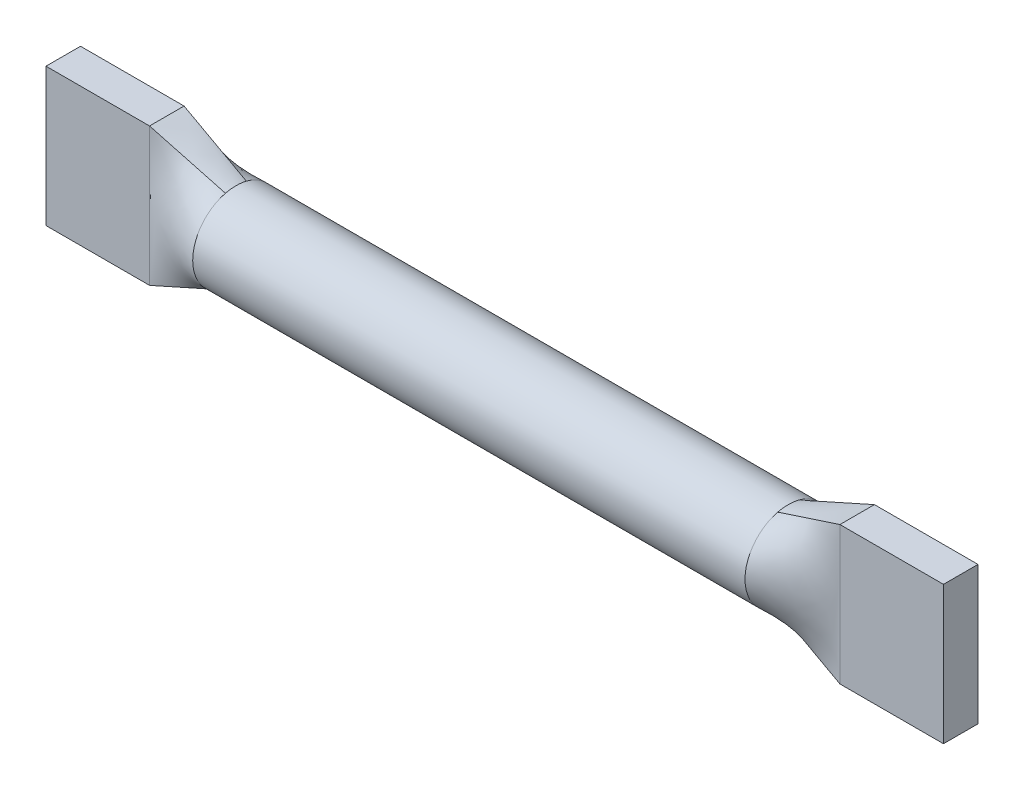
ISO-10303-21;
HEADER;
FILE_DESCRIPTION(('STEP AP214'),'2;1');
FILE_NAME('part.step','',(''),(''),'','','');
FILE_SCHEMA(('AUTOMOTIVE_DESIGN { 1 0 10303 214 1 1 1 1 }'));
ENDSEC;
DATA;
#1=APPLICATION_CONTEXT('core data for automotive mechanical design processes');
#2=APPLICATION_PROTOCOL_DEFINITION('international standard','automotive_design',2000,#1);
#3=PRODUCT_CONTEXT('',#1,'mechanical');
#4=PRODUCT('Part','Part','',(#3));
#5=PRODUCT_RELATED_PRODUCT_CATEGORY('part','',(#4));
#6=PRODUCT_DEFINITION_FORMATION('','',#4);
#7=PRODUCT_DEFINITION_CONTEXT('part definition',#1,'design');
#8=PRODUCT_DEFINITION('design','',#6,#7);
#9=PRODUCT_DEFINITION_SHAPE('','',#8);
#10=(LENGTH_UNIT() NAMED_UNIT(*) SI_UNIT(.MILLI.,.METRE.));
#11=(NAMED_UNIT(*) PLANE_ANGLE_UNIT() SI_UNIT($,.RADIAN.));
#12=(NAMED_UNIT(*) SI_UNIT($,.STERADIAN.) SOLID_ANGLE_UNIT());
#13=UNCERTAINTY_MEASURE_WITH_UNIT(LENGTH_MEASURE(1.E-05),#10,'distance_accuracy_value','');
#14=(GEOMETRIC_REPRESENTATION_CONTEXT(3) GLOBAL_UNCERTAINTY_ASSIGNED_CONTEXT((#13)) GLOBAL_UNIT_ASSIGNED_CONTEXT((#10,
#11,#12)) REPRESENTATION_CONTEXT('',''));
#15=CARTESIAN_POINT('',(0.,0.,0.));
#16=DIRECTION('',(0.,0.,1.));
#17=DIRECTION('',(1.,0.,0.));
#18=AXIS2_PLACEMENT_3D('',#15,#16,#17);
#19=CARTESIAN_POINT('',(4.,0.,0.));
#20=DIRECTION('',(-1.,0.,0.));
#21=DIRECTION('',(0.,0.,1.));
#22=AXIS2_PLACEMENT_3D('',#19,#20,#21);
#23=CYLINDRICAL_SURFACE('',#22,0.625);
#24=CARTESIAN_POINT('',(4.,0.606339039560121,-0.151584857770569));
#25=CARTESIAN_POINT('',(4.00002319869924,0.611432264371149,-0.131230323229949));
#26=CARTESIAN_POINT('',(4.00015953802985,0.615492700544378,-0.110614814075321));
#27=CARTESIAN_POINT('',(4.00045778826887,0.621521119742954,-0.069098322334352));
#28=CARTESIAN_POINT('',(4.00061967697582,0.623490908088315,-0.0481976018590627));
#29=CARTESIAN_POINT('',(4.00074736257878,0.625054477077351,-0.0123925371506096));
#30=CARTESIAN_POINT('',(4.00075644923271,0.625172099094219,0.00249072512299087));
#31=CARTESIAN_POINT('',(4.00068890808599,0.624345695991257,0.0322264147045635));
#32=CARTESIAN_POINT('',(4.00061229224982,0.62340181906183,0.0470788460267166));
#33=CARTESIAN_POINT('',(4.00041095379841,0.620425681626127,0.076990671397577));
#34=CARTESIAN_POINT('',(4.00028524940299,0.61837085688521,0.092047812070457));
#35=CARTESIAN_POINT('',(4.00008221403026,0.613170308925043,0.121976385342566));
#36=CARTESIAN_POINT('',(4.00000489433789,0.610024331477865,0.13684777382606));
#37=CARTESIAN_POINT('',(4.,0.606339018940256,0.151584940250014));
#38=B_SPLINE_CURVE_WITH_KNOTS('',3,(#24,#25,#26,#27,#28,#29,#30,#31,#32,#33,#34,#35,#36,#37),
.UNSPECIFIED.,.F.,.F.,(4,2,2,2,2,2,4),(0.,0.0629259388945802,0.125797495548134,
0.170412925881736,0.215022128457891,0.260573417572076,0.306135326829082),.UNSPECIFIED.);
#39=CARTESIAN_POINT('',(4.,0.606395418070268,-0.151598952407199));
#40=VERTEX_POINT('',#39);
#41=CARTESIAN_POINT('',(4.,0.606382766635631,0.151595877185707));
#42=VERTEX_POINT('',#41);
#43=EDGE_CURVE('E12',#40,#42,#38,.T.);
#44=ORIENTED_EDGE('',*,*,#43,.F.);
#45=CARTESIAN_POINT('',(4.,0.,0.));
#46=DIRECTION('',(1.,0.,0.));
#47=DIRECTION('',(0.,0.,-1.));
#48=AXIS2_PLACEMENT_3D('',#45,#46,#47);
#49=CIRCLE('',#48,0.625);
#50=CARTESIAN_POINT('',(4.,-0.606382766792094,-0.151595877225487));
#51=VERTEX_POINT('',#50);
#52=EDGE_CURVE('E119',#51,#40,#49,.T.);
#53=ORIENTED_EDGE('',*,*,#52,.F.);
#54=CARTESIAN_POINT('',(4.,-0.606339039560107,0.151584857770624));
#55=CARTESIAN_POINT('',(4.00002319869924,-0.611432264371138,0.131230323230004));
#56=CARTESIAN_POINT('',(4.00015953802985,-0.615492700544368,0.110614814075377));
#57=CARTESIAN_POINT('',(4.00045778826887,-0.621521119742948,0.0690983223344087));
#58=CARTESIAN_POINT('',(4.00061967697582,-0.62349090808831,0.0481976018591196));
#59=CARTESIAN_POINT('',(4.00074736257878,-0.625054477077352,0.01239253715061));
#60=CARTESIAN_POINT('',(4.00075644923271,-0.62517209909422,-0.00249072512304715));
#61=CARTESIAN_POINT('',(4.00068890808598,-0.62434569599125,-0.0322264147047328));
#62=CARTESIAN_POINT('',(4.00061229224982,-0.623401819061814,-0.0470788460269422));
#63=CARTESIAN_POINT('',(4.00041095379841,-0.620425681626086,-0.0769906713979176));
#64=CARTESIAN_POINT('',(4.00028524940299,-0.618370856885152,-0.0920478120708561));
#65=CARTESIAN_POINT('',(4.00008221403025,-0.613170308924942,-0.12197638534308));
#66=CARTESIAN_POINT('',(4.00000489433789,-0.610024331477738,-0.136847773826631));
#67=CARTESIAN_POINT('',(4.,-0.6063390189401,-0.151584940250639));
#68=B_SPLINE_CURVE_WITH_KNOTS('',3,(#54,#55,#56,#57,#58,#59,#60,#61,#62,#63,#64,#65,#66,#67),
.UNSPECIFIED.,.F.,.F.,(4,2,2,2,2,2,4),(0.,0.0629259388945799,0.125797495548134,
0.170412925881905,0.21502212845823,0.260573417572596,0.306135326829783),.UNSPECIFIED.);
#69=CARTESIAN_POINT('',(4.,-0.606395418103955,0.151598952415679));
#70=VERTEX_POINT('',#69);
#71=EDGE_CURVE('E428',#70,#51,#68,.T.);
#72=ORIENTED_EDGE('',*,*,#71,.F.);
#73=EDGE_CURVE('E508',#42,#70,#49,.T.);
#74=ORIENTED_EDGE('',*,*,#73,.F.);
#75=EDGE_LOOP('',(#44,#53,#72,#74));
#76=FACE_BOUND('',#75,.T.);
#77=CARTESIAN_POINT('',(-4.,0.606339062590832,0.151584765647708));
#78=CARTESIAN_POINT('',(-4.,0.618593964551617,0.102565157804571));
#79=CARTESIAN_POINT('',(-4.,0.624721415532009,0.0512825789022855));
#80=CARTESIAN_POINT('',(-4.,0.624721415532009,-0.0512825789022854));
#81=CARTESIAN_POINT('',(-4.,0.618593964551617,-0.102565157804571));
#82=CARTESIAN_POINT('',(-4.,0.606339062590832,-0.151584765647708));
#83=B_SPLINE_CURVE_WITH_KNOTS('',3,(#77,#78,#79,#80,#81,#82),.UNSPECIFIED.,.F.,.F.,(4,2,4),(0.,
0.5,1.),.UNSPECIFIED.);
#84=CARTESIAN_POINT('',(-4.,0.60705828899856,-0.151748952927144));
#85=VERTEX_POINT('',#84);
#86=CARTESIAN_POINT('',(-4.,0.607005347778301,0.151735841346693));
#87=VERTEX_POINT('',#86);
#88=EDGE_CURVE('E102',#85,#87,#83,.F.);
#89=ORIENTED_EDGE('',*,*,#88,.T.);
#90=CARTESIAN_POINT('',(-4.,0.,0.));
#91=DIRECTION('',(1.,0.,0.));
#92=DIRECTION('',(0.,0.,-1.));
#93=AXIS2_PLACEMENT_3D('',#90,#91,#92);
#94=CIRCLE('',#93,0.625);
#95=CARTESIAN_POINT('',(-4.,-0.607058251111747,0.151748944278222));
#96=VERTEX_POINT('',#95);
#97=EDGE_CURVE('E110',#87,#96,#94,.T.);
#98=ORIENTED_EDGE('',*,*,#97,.T.);
#99=CARTESIAN_POINT('',(-4.,-0.60700538806345,-0.151735850481081));
#100=VERTEX_POINT('',#99);
#101=EDGE_CURVE('E303',#96,#100,#94,.T.);
#102=ORIENTED_EDGE('',*,*,#101,.T.);
#103=EDGE_CURVE('E198',#100,#85,#94,.T.);
#104=ORIENTED_EDGE('',*,*,#103,.T.);
#105=EDGE_LOOP('',(#89,#98,#102,#104));
#106=FACE_BOUND('',#105,.T.);
#107=ADVANCED_FACE('F92',(#76,#106),#23,.T.);
#108=CARTESIAN_POINT('',(5.,-1.,0.25));
#109=CARTESIAN_POINT('',(4.,-0.606339062590832,0.151584765647708));
#110=CARTESIAN_POINT('',(5.,-0.833333333333333,0.25));
#111=CARTESIAN_POINT('',(4.,-0.581829258669264,0.249623981333983));
#112=CARTESIAN_POINT('',(5.,-0.666666666666667,0.25));
#113=CARTESIAN_POINT('',(4.,-0.527266641714546,0.364058002825046));
#114=CARTESIAN_POINT('',(5.,-0.416666666666667,0.25));
#115=CARTESIAN_POINT('',(4.,-0.371541972222834,0.507506057203499));
#116=CARTESIAN_POINT('',(5.,-0.333333333333333,0.25));
#117=CARTESIAN_POINT('',(4.,-0.307632412302998,0.549659321541145));
#118=CARTESIAN_POINT('',(5.,-0.166666666666666,0.25));
#119=CARTESIAN_POINT('',(4.,-0.162442635781475,0.60858480176291));
#120=CARTESIAN_POINT('',(5.,-0.083333333333333,0.25));
#121=CARTESIAN_POINT('',(4.,-0.0813308756671265,0.625));
#122=CARTESIAN_POINT('',(5.,0.0833333333333337,0.25));
#123=CARTESIAN_POINT('',(4.,0.0813308756671266,0.625));
#124=CARTESIAN_POINT('',(5.,0.166666666666667,0.25));
#125=CARTESIAN_POINT('',(4.,0.162442635781475,0.60858480176291));
#126=CARTESIAN_POINT('',(5.,0.333333333333333,0.25));
#127=CARTESIAN_POINT('',(4.,0.307632412302998,0.549659321541145));
#128=CARTESIAN_POINT('',(5.,0.416666666666667,0.25));
#129=CARTESIAN_POINT('',(4.,0.371541972222834,0.507506057203499));
#130=CARTESIAN_POINT('',(5.,0.666666666666667,0.25));
#131=CARTESIAN_POINT('',(4.,0.527266641714546,0.364058002825045));
#132=CARTESIAN_POINT('',(5.,0.833333333333333,0.25));
#133=CARTESIAN_POINT('',(4.,0.581829258669264,0.249623981333983));
#134=CARTESIAN_POINT('',(5.,1.,0.25));
#135=CARTESIAN_POINT('',(4.,0.606339062590832,0.151584765647708));
#136=B_SPLINE_SURFACE_WITH_KNOTS('',3,1,((#108,#109),(#110,#111),(#112,#113),(#114,#115),(#116,
#117),(#118,#119),(#120,#121),(#122,#123),(#124,#125),(#126,#127),(#128,#129),(#130,#131),(#132,
#133),(#134,#135)),.UNSPECIFIED.,.F.,.F.,.F.,(4,2,2,2,2,2,4),(2,2),(0.,0.25,0.375,0.5,0.625,
0.75,1.),(0.,1.),.UNSPECIFIED.);
#137=DIRECTION('',(0.,-1.,0.));
#138=VECTOR('',#137,1.);
#139=CARTESIAN_POINT('',(5.,-1.,0.25));
#140=LINE('',#139,#138);
#141=CARTESIAN_POINT('',(5.,1.,0.25));
#142=VERTEX_POINT('',#141);
#143=CARTESIAN_POINT('',(5.,-1.,0.25));
#144=VERTEX_POINT('',#143);
#145=EDGE_CURVE('E573',#142,#144,#140,.T.);
#146=DIRECTION('',(-0.926619524762666,-0.364773910739708,-0.0911934776849271));
#147=VECTOR('',#146,1.);
#148=CARTESIAN_POINT('',(4.5,0.803169531295416,0.200792382823854));
#149=LINE('',#148,#147);
#150=EDGE_CURVE('E570',#142,#42,#149,.T.);
#151=DIRECTION('',(0.926619524762666,-0.364773910739708,0.0911934776849269));
#152=VECTOR('',#151,1.);
#153=CARTESIAN_POINT('',(4.5,-0.803169531295416,0.200792382823854));
#154=LINE('',#153,#152);
#155=EDGE_CURVE('E574',#70,#144,#154,.T.);
#156=ORIENTED_EDGE('',*,*,#145,.F.);
#157=ORIENTED_EDGE('',*,*,#150,.T.);
#158=ORIENTED_EDGE('',*,*,#73,.T.);
#159=ORIENTED_EDGE('',*,*,#155,.T.);
#160=EDGE_LOOP('',(#156,#157,#158,#159));
#161=FACE_BOUND('',#160,.T.);
#162=ADVANCED_FACE('F460',(#161),#136,.T.);
#163=CARTESIAN_POINT('',(5.,1.,0.255));
#164=CARTESIAN_POINT('',(4.,0.605603768473185,0.154525942118296));
#165=CARTESIAN_POINT('',(5.,1.,0.253333333333333));
#166=CARTESIAN_POINT('',(4.,0.605848866512401,0.153545549961434));
#167=CARTESIAN_POINT('',(5.,1.,0.251666666666667));
#168=CARTESIAN_POINT('',(4.,0.606093964551617,0.152565157804571));
#169=CARTESIAN_POINT('',(5.,1.,0.25));
#170=CARTESIAN_POINT('',(4.,0.606339062590832,0.151584765647708));
#171=CARTESIAN_POINT('',(5.,1.,0.166666666666667));
#172=CARTESIAN_POINT('',(4.,0.618593964551617,0.102565157804571));
#173=CARTESIAN_POINT('',(5.,1.,0.0833333333333332));
#174=CARTESIAN_POINT('',(4.,0.624721415532009,0.0512825789022855));
#175=CARTESIAN_POINT('',(5.,1.,-0.0833333333333334));
#176=CARTESIAN_POINT('',(4.,0.624721415532009,-0.0512825789022854));
#177=CARTESIAN_POINT('',(5.,1.,-0.166666666666667));
#178=CARTESIAN_POINT('',(4.,0.618593964551617,-0.102565157804571));
#179=CARTESIAN_POINT('',(5.,1.,-0.25));
#180=CARTESIAN_POINT('',(4.,0.606339062590832,-0.151584765647708));
#181=CARTESIAN_POINT('',(5.,1.,-0.251666666666667));
#182=CARTESIAN_POINT('',(4.,0.606093964551617,-0.152565157804571));
#183=CARTESIAN_POINT('',(5.,1.,-0.253333333333333));
#184=CARTESIAN_POINT('',(4.,0.605848866512401,-0.153545549961434));
#185=CARTESIAN_POINT('',(5.,1.,-0.255));
#186=CARTESIAN_POINT('',(4.,0.605603768473185,-0.154525942118296));
#187=B_SPLINE_SURFACE_WITH_KNOTS('',3,1,((#163,#164),(#165,#166),(#167,#168),(#169,#170),(#171,
#172),(#173,#174),(#175,#176),(#177,#178),(#179,#180),(#181,#182),(#183,#184),(#185,#186)),
.UNSPECIFIED.,.F.,.F.,.F.,(4,3,2,3,4),(2,2),(-0.01,0.,0.5,1.,1.01),(0.,1.),.UNSPECIFIED.);
#188=DIRECTION('',(0.,0.,1.));
#189=VECTOR('',#188,1.);
#190=CARTESIAN_POINT('',(5.,1.,-0.25));
#191=LINE('',#190,#189);
#192=CARTESIAN_POINT('',(5.,1.,-0.25));
#193=VERTEX_POINT('',#192);
#194=EDGE_CURVE('E441',#193,#142,#191,.T.);
#195=DIRECTION('',(-0.926619524762666,-0.364773910739708,0.0911934776849271));
#196=VECTOR('',#195,1.);
#197=CARTESIAN_POINT('',(4.5,0.803169531295416,-0.200792382823854));
#198=LINE('',#197,#196);
#199=EDGE_CURVE('E572',#193,#40,#198,.T.);
#200=ORIENTED_EDGE('',*,*,#194,.F.);
#201=ORIENTED_EDGE('',*,*,#199,.T.);
#202=ORIENTED_EDGE('',*,*,#43,.T.);
#203=ORIENTED_EDGE('',*,*,#150,.F.);
#204=EDGE_LOOP('',(#200,#201,#202,#203));
#205=FACE_BOUND('',#204,.T.);
#206=ADVANCED_FACE('F406',(#205),#187,.T.);
#207=CARTESIAN_POINT('',(5.,-1.,-0.255));
#208=CARTESIAN_POINT('',(4.,-0.605603768473185,-0.154525942118296));
#209=CARTESIAN_POINT('',(5.,-1.,-0.253333333333333));
#210=CARTESIAN_POINT('',(4.,-0.605848866512401,-0.153545549961434));
#211=CARTESIAN_POINT('',(5.,-1.,-0.251666666666667));
#212=CARTESIAN_POINT('',(4.,-0.606093964551617,-0.152565157804571));
#213=CARTESIAN_POINT('',(5.,-1.,-0.25));
#214=CARTESIAN_POINT('',(4.,-0.606339062590832,-0.151584765647708));
#215=CARTESIAN_POINT('',(5.,-1.,-0.166666666666667));
#216=CARTESIAN_POINT('',(4.,-0.618593964551617,-0.102565157804571));
#217=CARTESIAN_POINT('',(5.,-1.,-0.0833333333333332));
#218=CARTESIAN_POINT('',(4.,-0.624721415532009,-0.0512825789022853));
#219=CARTESIAN_POINT('',(5.,-1.,0.0833333333333334));
#220=CARTESIAN_POINT('',(4.,-0.624721415532009,0.0512825789022856));
#221=CARTESIAN_POINT('',(5.,-1.,0.166666666666667));
#222=CARTESIAN_POINT('',(4.,-0.618593964551617,0.102565157804571));
#223=CARTESIAN_POINT('',(5.,-1.,0.25));
#224=CARTESIAN_POINT('',(4.,-0.606339062590832,0.151584765647708));
#225=CARTESIAN_POINT('',(5.,-1.,0.251666666666667));
#226=CARTESIAN_POINT('',(4.,-0.606093964551617,0.152565157804571));
#227=CARTESIAN_POINT('',(5.,-1.,0.253333333333333));
#228=CARTESIAN_POINT('',(4.,-0.605848866512401,0.153545549961434));
#229=CARTESIAN_POINT('',(5.,-1.,0.255));
#230=CARTESIAN_POINT('',(4.,-0.605603768473185,0.154525942118296));
#231=B_SPLINE_SURFACE_WITH_KNOTS('',3,1,((#207,#208),(#209,#210),(#211,#212),(#213,#214),(#215,
#216),(#217,#218),(#219,#220),(#221,#222),(#223,#224),(#225,#226),(#227,#228),(#229,#230)),
.UNSPECIFIED.,.F.,.F.,.F.,(4,3,2,3,4),(2,2),(-0.01,0.,0.5,1.,1.01),(0.,1.),.UNSPECIFIED.);
#232=DIRECTION('',(0.,0.,-1.));
#233=VECTOR('',#232,1.);
#234=CARTESIAN_POINT('',(5.,-1.,-0.25));
#235=LINE('',#234,#233);
#236=CARTESIAN_POINT('',(5.,-1.,-0.25));
#237=VERTEX_POINT('',#236);
#238=EDGE_CURVE('E386',#144,#237,#235,.T.);
#239=DIRECTION('',(-0.926619524762666,0.364773910739708,0.0911934776849271));
#240=VECTOR('',#239,1.);
#241=CARTESIAN_POINT('',(4.5,-0.803169531295416,-0.200792382823854));
#242=LINE('',#241,#240);
#243=EDGE_CURVE('E392',#237,#51,#242,.T.);
#244=ORIENTED_EDGE('',*,*,#238,.F.);
#245=ORIENTED_EDGE('',*,*,#155,.F.);
#246=ORIENTED_EDGE('',*,*,#71,.T.);
#247=ORIENTED_EDGE('',*,*,#243,.F.);
#248=EDGE_LOOP('',(#244,#245,#246,#247));
#249=FACE_BOUND('',#248,.T.);
#250=ADVANCED_FACE('F394',(#249),#231,.T.);
#251=CARTESIAN_POINT('',(5.,1.,-0.25));
#252=CARTESIAN_POINT('',(4.,0.606339062590832,-0.151584765647708));
#253=CARTESIAN_POINT('',(5.,0.833333333333333,-0.25));
#254=CARTESIAN_POINT('',(4.,0.581829258669264,-0.249623981333983));
#255=CARTESIAN_POINT('',(5.,0.666666666666666,-0.25));
#256=CARTESIAN_POINT('',(4.,0.527266641714546,-0.364058002825045));
#257=CARTESIAN_POINT('',(5.,0.416666666666666,-0.25));
#258=CARTESIAN_POINT('',(4.,0.371541972222834,-0.507506057203499));
#259=CARTESIAN_POINT('',(5.,0.333333333333333,-0.25));
#260=CARTESIAN_POINT('',(4.,0.307632412302998,-0.549659321541145));
#261=CARTESIAN_POINT('',(5.,0.166666666666666,-0.25));
#262=CARTESIAN_POINT('',(4.,0.162442635781475,-0.60858480176291));
#263=CARTESIAN_POINT('',(5.,0.0833333333333329,-0.25));
#264=CARTESIAN_POINT('',(4.,0.0813308756671265,-0.625));
#265=CARTESIAN_POINT('',(5.,-0.0833333333333338,-0.25));
#266=CARTESIAN_POINT('',(4.,-0.0813308756671266,-0.625));
#267=CARTESIAN_POINT('',(5.,-0.166666666666667,-0.25));
#268=CARTESIAN_POINT('',(4.,-0.162442635781475,-0.60858480176291));
#269=CARTESIAN_POINT('',(5.,-0.333333333333334,-0.25));
#270=CARTESIAN_POINT('',(4.,-0.307632412302998,-0.549659321541145));
#271=CARTESIAN_POINT('',(5.,-0.416666666666667,-0.25));
#272=CARTESIAN_POINT('',(4.,-0.371541972222834,-0.507506057203499));
#273=CARTESIAN_POINT('',(5.,-0.666666666666667,-0.25));
#274=CARTESIAN_POINT('',(4.,-0.527266641714546,-0.364058002825045));
#275=CARTESIAN_POINT('',(5.,-0.833333333333334,-0.25));
#276=CARTESIAN_POINT('',(4.,-0.581829258669264,-0.249623981333983));
#277=CARTESIAN_POINT('',(5.,-1.,-0.25));
#278=CARTESIAN_POINT('',(4.,-0.606339062590832,-0.151584765647708));
#279=B_SPLINE_SURFACE_WITH_KNOTS('',3,1,((#251,#252),(#253,#254),(#255,#256),(#257,#258),(#259,
#260),(#261,#262),(#263,#264),(#265,#266),(#267,#268),(#269,#270),(#271,#272),(#273,#274),(#275,
#276),(#277,#278)),.UNSPECIFIED.,.F.,.F.,.F.,(4,2,2,2,2,2,4),(2,2),(0.,0.25,0.375,0.5,0.625,
0.75,1.),(0.,1.),.UNSPECIFIED.);
#280=DIRECTION('',(0.,1.,0.));
#281=VECTOR('',#280,1.);
#282=CARTESIAN_POINT('',(5.,-1.,-0.25));
#283=LINE('',#282,#281);
#284=EDGE_CURVE('E525',#237,#193,#283,.T.);
#285=ORIENTED_EDGE('',*,*,#284,.F.);
#286=ORIENTED_EDGE('',*,*,#243,.T.);
#287=ORIENTED_EDGE('',*,*,#52,.T.);
#288=ORIENTED_EDGE('',*,*,#199,.F.);
#289=EDGE_LOOP('',(#285,#286,#287,#288));
#290=FACE_BOUND('',#289,.T.);
#291=ADVANCED_FACE('F405',(#290),#279,.T.);
#292=CARTESIAN_POINT('',(6.5,1.,-0.25));
#293=DIRECTION('',(0.,-1.,0.));
#294=DIRECTION('',(0.,0.,-1.));
#295=AXIS2_PLACEMENT_3D('',#292,#293,#294);
#296=PLANE('',#295);
#297=ORIENTED_EDGE('',*,*,#194,.T.);
#298=DIRECTION('',(-1.,0.,0.));
#299=VECTOR('',#298,1.);
#300=CARTESIAN_POINT('',(6.5,1.,0.25));
#301=LINE('',#300,#299);
#302=CARTESIAN_POINT('',(6.5,1.,0.25));
#303=VERTEX_POINT('',#302);
#304=EDGE_CURVE('E430',#303,#142,#301,.T.);
#305=ORIENTED_EDGE('',*,*,#304,.F.);
#306=DIRECTION('',(0.,0.,1.));
#307=VECTOR('',#306,1.);
#308=CARTESIAN_POINT('',(6.5,1.,-0.25));
#309=LINE('',#308,#307);
#310=CARTESIAN_POINT('',(6.5,1.,-0.25));
#311=VERTEX_POINT('',#310);
#312=EDGE_CURVE('E370',#311,#303,#309,.T.);
#313=ORIENTED_EDGE('',*,*,#312,.F.);
#314=DIRECTION('',(-1.,0.,0.));
#315=VECTOR('',#314,1.);
#316=CARTESIAN_POINT('',(6.5,1.,-0.25));
#317=LINE('',#316,#315);
#318=EDGE_CURVE('E379',#311,#193,#317,.T.);
#319=ORIENTED_EDGE('',*,*,#318,.T.);
#320=EDGE_LOOP('',(#297,#305,#313,#319));
#321=FACE_BOUND('',#320,.T.);
#322=ADVANCED_FACE('F448',(#321),#296,.F.);
#323=CARTESIAN_POINT('',(6.5,1.,0.25));
#324=DIRECTION('',(0.,0.,-1.));
#325=DIRECTION('',(-1.,0.,0.));
#326=AXIS2_PLACEMENT_3D('',#323,#324,#325);
#327=PLANE('',#326);
#328=ORIENTED_EDGE('',*,*,#145,.T.);
#329=DIRECTION('',(-1.,0.,0.));
#330=VECTOR('',#329,1.);
#331=CARTESIAN_POINT('',(6.5,-1.,0.25));
#332=LINE('',#331,#330);
#333=CARTESIAN_POINT('',(6.5,-1.,0.25));
#334=VERTEX_POINT('',#333);
#335=EDGE_CURVE('E433',#334,#144,#332,.T.);
#336=ORIENTED_EDGE('',*,*,#335,.F.);
#337=DIRECTION('',(0.,-1.,0.));
#338=VECTOR('',#337,1.);
#339=CARTESIAN_POINT('',(6.5,1.,0.25));
#340=LINE('',#339,#338);
#341=EDGE_CURVE('E373',#303,#334,#340,.T.);
#342=ORIENTED_EDGE('',*,*,#341,.F.);
#343=ORIENTED_EDGE('',*,*,#304,.T.);
#344=EDGE_LOOP('',(#328,#336,#342,#343));
#345=FACE_BOUND('',#344,.T.);
#346=ADVANCED_FACE('F457',(#345),#327,.F.);
#347=CARTESIAN_POINT('',(6.5,-1.,0.25));
#348=DIRECTION('',(0.,1.,0.));
#349=DIRECTION('',(0.,0.,1.));
#350=AXIS2_PLACEMENT_3D('',#347,#348,#349);
#351=PLANE('',#350);
#352=ORIENTED_EDGE('',*,*,#238,.T.);
#353=DIRECTION('',(-1.,0.,0.));
#354=VECTOR('',#353,1.);
#355=CARTESIAN_POINT('',(6.5,-1.,-0.25));
#356=LINE('',#355,#354);
#357=CARTESIAN_POINT('',(6.5,-1.,-0.25));
#358=VERTEX_POINT('',#357);
#359=EDGE_CURVE('E533',#358,#237,#356,.T.);
#360=ORIENTED_EDGE('',*,*,#359,.F.);
#361=DIRECTION('',(0.,0.,-1.));
#362=VECTOR('',#361,1.);
#363=CARTESIAN_POINT('',(6.5,-1.,0.25));
#364=LINE('',#363,#362);
#365=EDGE_CURVE('E375',#334,#358,#364,.T.);
#366=ORIENTED_EDGE('',*,*,#365,.F.);
#367=ORIENTED_EDGE('',*,*,#335,.T.);
#368=EDGE_LOOP('',(#352,#360,#366,#367));
#369=FACE_BOUND('',#368,.T.);
#370=ADVANCED_FACE('F546',(#369),#351,.F.);
#371=CARTESIAN_POINT('',(6.5,-1.,-0.25));
#372=DIRECTION('',(0.,0.,1.));
#373=DIRECTION('',(1.,0.,0.));
#374=AXIS2_PLACEMENT_3D('',#371,#372,#373);
#375=PLANE('',#374);
#376=ORIENTED_EDGE('',*,*,#284,.T.);
#377=ORIENTED_EDGE('',*,*,#318,.F.);
#378=DIRECTION('',(0.,1.,0.));
#379=VECTOR('',#378,1.);
#380=CARTESIAN_POINT('',(6.5,-1.,-0.25));
#381=LINE('',#380,#379);
#382=EDGE_CURVE('E377',#358,#311,#381,.T.);
#383=ORIENTED_EDGE('',*,*,#382,.F.);
#384=ORIENTED_EDGE('',*,*,#359,.T.);
#385=EDGE_LOOP('',(#376,#377,#383,#384));
#386=FACE_BOUND('',#385,.T.);
#387=ADVANCED_FACE('F554',(#386),#375,.F.);
#388=CARTESIAN_POINT('',(6.5,0.,0.));
#389=DIRECTION('',(1.,0.,0.));
#390=DIRECTION('',(0.,0.,-1.));
#391=AXIS2_PLACEMENT_3D('',#388,#389,#390);
#392=PLANE('',#391);
#393=ORIENTED_EDGE('',*,*,#312,.T.);
#394=ORIENTED_EDGE('',*,*,#341,.T.);
#395=ORIENTED_EDGE('',*,*,#365,.T.);
#396=ORIENTED_EDGE('',*,*,#382,.T.);
#397=EDGE_LOOP('',(#393,#394,#395,#396));
#398=FACE_BOUND('',#397,.T.);
#399=ADVANCED_FACE('F557',(#398),#392,.T.);
#400=CARTESIAN_POINT('',(-5.,-1.,0.25));
#401=CARTESIAN_POINT('',(-4.,-0.606339062590832,0.151584765647708));
#402=CARTESIAN_POINT('',(-5.,-0.833333333333333,0.25));
#403=CARTESIAN_POINT('',(-4.,-0.581829258669264,0.249623981333983));
#404=CARTESIAN_POINT('',(-5.,-0.666666666666667,0.25));
#405=CARTESIAN_POINT('',(-4.,-0.527266641714546,0.364058002825046));
#406=CARTESIAN_POINT('',(-5.,-0.416666666666667,0.25));
#407=CARTESIAN_POINT('',(-4.,-0.371541972222834,0.507506057203499));
#408=CARTESIAN_POINT('',(-5.,-0.333333333333333,0.25));
#409=CARTESIAN_POINT('',(-4.,-0.307632412302998,0.549659321541145));
#410=CARTESIAN_POINT('',(-5.,-0.166666666666666,0.25));
#411=CARTESIAN_POINT('',(-4.,-0.162442635781475,0.60858480176291));
#412=CARTESIAN_POINT('',(-5.,-0.083333333333333,0.25));
#413=CARTESIAN_POINT('',(-4.,-0.0813308756671265,0.625));
#414=CARTESIAN_POINT('',(-5.,0.0833333333333337,0.25));
#415=CARTESIAN_POINT('',(-4.,0.0813308756671266,0.625));
#416=CARTESIAN_POINT('',(-5.,0.166666666666667,0.25));
#417=CARTESIAN_POINT('',(-4.,0.162442635781475,0.60858480176291));
#418=CARTESIAN_POINT('',(-5.,0.333333333333333,0.25));
#419=CARTESIAN_POINT('',(-4.,0.307632412302998,0.549659321541145));
#420=CARTESIAN_POINT('',(-5.,0.416666666666667,0.25));
#421=CARTESIAN_POINT('',(-4.,0.371541972222834,0.507506057203499));
#422=CARTESIAN_POINT('',(-5.,0.666666666666667,0.25));
#423=CARTESIAN_POINT('',(-4.,0.527266641714546,0.364058002825045));
#424=CARTESIAN_POINT('',(-5.,0.833333333333333,0.25));
#425=CARTESIAN_POINT('',(-4.,0.581829258669264,0.249623981333983));
#426=CARTESIAN_POINT('',(-5.,1.,0.25));
#427=CARTESIAN_POINT('',(-4.,0.606339062590832,0.151584765647708));
#428=B_SPLINE_SURFACE_WITH_KNOTS('',3,1,((#400,#401),(#402,#403),(#404,#405),(#406,#407),(#408,
#409),(#410,#411),(#412,#413),(#414,#415),(#416,#417),(#418,#419),(#420,#421),(#422,#423),(#424,
#425),(#426,#427)),.UNSPECIFIED.,.F.,.F.,.F.,(4,2,2,2,2,2,4),(2,2),(0.,0.25,0.375,0.5,0.625,
0.75,1.),(0.,1.),.UNSPECIFIED.);
#429=DIRECTION('',(0.,-1.,0.));
#430=VECTOR('',#429,1.);
#431=CARTESIAN_POINT('',(-5.,-1.,0.25));
#432=LINE('',#431,#430);
#433=CARTESIAN_POINT('',(-5.,1.,0.25));
#434=VERTEX_POINT('',#433);
#435=CARTESIAN_POINT('',(-5.,-1.,0.25));
#436=VERTEX_POINT('',#435);
#437=EDGE_CURVE('E365',#434,#436,#432,.T.);
#438=DIRECTION('',(-0.926619524762666,-0.364773910739708,0.0911934776849269));
#439=VECTOR('',#438,1.);
#440=CARTESIAN_POINT('',(-4.5,-0.803169531295416,0.200792382823854));
#441=LINE('',#440,#439);
#442=EDGE_CURVE('E712',#96,#436,#441,.T.);
#443=DIRECTION('',(0.926619524762666,-0.364773910739708,-0.0911934776849271));
#444=VECTOR('',#443,1.);
#445=CARTESIAN_POINT('',(-4.5,0.803169531295416,0.200792382823854));
#446=LINE('',#445,#444);
#447=EDGE_CURVE('E708',#434,#87,#446,.T.);
#448=ORIENTED_EDGE('',*,*,#437,.T.);
#449=ORIENTED_EDGE('',*,*,#442,.F.);
#450=ORIENTED_EDGE('',*,*,#97,.F.);
#451=ORIENTED_EDGE('',*,*,#447,.F.);
#452=EDGE_LOOP('',(#448,#449,#450,#451));
#453=FACE_BOUND('',#452,.T.);
#454=ADVANCED_FACE('F560',(#453),#428,.F.);
#455=CARTESIAN_POINT('',(-5.,1.,0.25));
#456=CARTESIAN_POINT('',(-4.,0.606339062590832,0.151584765647708));
#457=CARTESIAN_POINT('',(-5.,1.,0.166666666666667));
#458=CARTESIAN_POINT('',(-4.,0.618593964551617,0.102565157804571));
#459=CARTESIAN_POINT('',(-5.,1.,0.0833333333333332));
#460=CARTESIAN_POINT('',(-4.,0.624721415532009,0.0512825789022855));
#461=CARTESIAN_POINT('',(-5.,1.,-0.0833333333333334));
#462=CARTESIAN_POINT('',(-4.,0.624721415532009,-0.0512825789022854));
#463=CARTESIAN_POINT('',(-5.,1.,-0.166666666666667));
#464=CARTESIAN_POINT('',(-4.,0.618593964551617,-0.102565157804571));
#465=CARTESIAN_POINT('',(-5.,1.,-0.25));
#466=CARTESIAN_POINT('',(-4.,0.606339062590832,-0.151584765647708));
#467=B_SPLINE_SURFACE_WITH_KNOTS('',3,1,((#455,#456),(#457,#458),(#459,#460),(#461,#462),(#463,
#464),(#465,#466)),.UNSPECIFIED.,.F.,.F.,.F.,(4,2,4),(2,2),(0.,0.5,1.),(0.,1.),.UNSPECIFIED.);
#468=DIRECTION('',(0.,0.,1.));
#469=VECTOR('',#468,1.);
#470=CARTESIAN_POINT('',(-5.,1.,-0.25));
#471=LINE('',#470,#469);
#472=CARTESIAN_POINT('',(-5.,1.,-0.25));
#473=VERTEX_POINT('',#472);
#474=EDGE_CURVE('E193',#473,#434,#471,.T.);
#475=DIRECTION('',(0.926619524762666,-0.364773910739708,0.0911934776849271));
#476=VECTOR('',#475,1.);
#477=CARTESIAN_POINT('',(-4.5,0.803169531295416,-0.200792382823854));
#478=LINE('',#477,#476);
#479=EDGE_CURVE('E323',#473,#85,#478,.T.);
#480=ORIENTED_EDGE('',*,*,#474,.T.);
#481=ORIENTED_EDGE('',*,*,#447,.T.);
#482=ORIENTED_EDGE('',*,*,#88,.F.);
#483=ORIENTED_EDGE('',*,*,#479,.F.);
#484=EDGE_LOOP('',(#480,#481,#482,#483));
#485=FACE_BOUND('',#484,.T.);
#486=ADVANCED_FACE('F243',(#485),#467,.F.);
#487=CARTESIAN_POINT('',(-5.,-1.,-0.25));
#488=CARTESIAN_POINT('',(-4.,-0.606339062590832,-0.151584765647708));
#489=CARTESIAN_POINT('',(-5.,-1.,-0.166666666666667));
#490=CARTESIAN_POINT('',(-4.,-0.618593964551617,-0.102565157804571));
#491=CARTESIAN_POINT('',(-5.,-1.,-0.0833333333333332));
#492=CARTESIAN_POINT('',(-4.,-0.624721415532009,-0.0512825789022853));
#493=CARTESIAN_POINT('',(-5.,-1.,0.0833333333333334));
#494=CARTESIAN_POINT('',(-4.,-0.624721415532009,0.0512825789022856));
#495=CARTESIAN_POINT('',(-5.,-1.,0.166666666666667));
#496=CARTESIAN_POINT('',(-4.,-0.618593964551617,0.102565157804571));
#497=CARTESIAN_POINT('',(-5.,-1.,0.25));
#498=CARTESIAN_POINT('',(-4.,-0.606339062590832,0.151584765647708));
#499=B_SPLINE_SURFACE_WITH_KNOTS('',3,1,((#487,#488),(#489,#490),(#491,#492),(#493,#494),(#495,
#496),(#497,#498)),.UNSPECIFIED.,.F.,.F.,.F.,(4,2,4),(2,2),(0.,0.5,1.),(0.,1.),.UNSPECIFIED.);
#500=DIRECTION('',(0.,0.,-1.));
#501=VECTOR('',#500,1.);
#502=CARTESIAN_POINT('',(-5.,-1.,-0.25));
#503=LINE('',#502,#501);
#504=CARTESIAN_POINT('',(-5.,-1.,-0.25));
#505=VERTEX_POINT('',#504);
#506=EDGE_CURVE('E223',#436,#505,#503,.T.);
#507=DIRECTION('',(0.926619524762666,0.364773910739708,0.0911934776849271));
#508=VECTOR('',#507,1.);
#509=CARTESIAN_POINT('',(-4.5,-0.803169531295416,-0.200792382823854));
#510=LINE('',#509,#508);
#511=EDGE_CURVE('E228',#505,#100,#510,.T.);
#512=ORIENTED_EDGE('',*,*,#506,.T.);
#513=ORIENTED_EDGE('',*,*,#511,.T.);
#514=ORIENTED_EDGE('',*,*,#101,.F.);
#515=ORIENTED_EDGE('',*,*,#442,.T.);
#516=EDGE_LOOP('',(#512,#513,#514,#515));
#517=FACE_BOUND('',#516,.T.);
#518=ADVANCED_FACE('F230',(#517),#499,.F.);
#519=CARTESIAN_POINT('',(-5.,1.,-0.25));
#520=CARTESIAN_POINT('',(-4.,0.606339062590832,-0.151584765647708));
#521=CARTESIAN_POINT('',(-5.,0.833333333333333,-0.25));
#522=CARTESIAN_POINT('',(-4.,0.581829258669264,-0.249623981333983));
#523=CARTESIAN_POINT('',(-5.,0.666666666666666,-0.25));
#524=CARTESIAN_POINT('',(-4.,0.527266641714546,-0.364058002825045));
#525=CARTESIAN_POINT('',(-5.,0.416666666666666,-0.25));
#526=CARTESIAN_POINT('',(-4.,0.371541972222834,-0.507506057203499));
#527=CARTESIAN_POINT('',(-5.,0.333333333333333,-0.25));
#528=CARTESIAN_POINT('',(-4.,0.307632412302998,-0.549659321541145));
#529=CARTESIAN_POINT('',(-5.,0.166666666666666,-0.25));
#530=CARTESIAN_POINT('',(-4.,0.162442635781475,-0.60858480176291));
#531=CARTESIAN_POINT('',(-5.,0.0833333333333329,-0.25));
#532=CARTESIAN_POINT('',(-4.,0.0813308756671265,-0.625));
#533=CARTESIAN_POINT('',(-5.,-0.0833333333333338,-0.25));
#534=CARTESIAN_POINT('',(-4.,-0.0813308756671266,-0.625));
#535=CARTESIAN_POINT('',(-5.,-0.166666666666667,-0.25));
#536=CARTESIAN_POINT('',(-4.,-0.162442635781475,-0.60858480176291));
#537=CARTESIAN_POINT('',(-5.,-0.333333333333334,-0.25));
#538=CARTESIAN_POINT('',(-4.,-0.307632412302998,-0.549659321541145));
#539=CARTESIAN_POINT('',(-5.,-0.416666666666667,-0.25));
#540=CARTESIAN_POINT('',(-4.,-0.371541972222834,-0.507506057203499));
#541=CARTESIAN_POINT('',(-5.,-0.666666666666667,-0.25));
#542=CARTESIAN_POINT('',(-4.,-0.527266641714546,-0.364058002825045));
#543=CARTESIAN_POINT('',(-5.,-0.833333333333334,-0.25));
#544=CARTESIAN_POINT('',(-4.,-0.581829258669264,-0.249623981333983));
#545=CARTESIAN_POINT('',(-5.,-1.,-0.25));
#546=CARTESIAN_POINT('',(-4.,-0.606339062590832,-0.151584765647708));
#547=B_SPLINE_SURFACE_WITH_KNOTS('',3,1,((#519,#520),(#521,#522),(#523,#524),(#525,#526),(#527,
#528),(#529,#530),(#531,#532),(#533,#534),(#535,#536),(#537,#538),(#539,#540),(#541,#542),(#543,
#544),(#545,#546)),.UNSPECIFIED.,.F.,.F.,.F.,(4,2,2,2,2,2,4),(2,2),(0.,0.25,0.375,0.5,0.625,
0.75,1.),(0.,1.),.UNSPECIFIED.);
#548=DIRECTION('',(0.,1.,0.));
#549=VECTOR('',#548,1.);
#550=CARTESIAN_POINT('',(-5.,-1.,-0.25));
#551=LINE('',#550,#549);
#552=EDGE_CURVE('E96',#505,#473,#551,.T.);
#553=ORIENTED_EDGE('',*,*,#552,.T.);
#554=ORIENTED_EDGE('',*,*,#479,.T.);
#555=ORIENTED_EDGE('',*,*,#103,.F.);
#556=ORIENTED_EDGE('',*,*,#511,.F.);
#557=EDGE_LOOP('',(#553,#554,#555,#556));
#558=FACE_BOUND('',#557,.T.);
#559=ADVANCED_FACE('F242',(#558),#547,.F.);
#560=CARTESIAN_POINT('',(-6.5,1.,-0.25));
#561=DIRECTION('',(0.,1.,0.));
#562=DIRECTION('',(0.,0.,1.));
#563=AXIS2_PLACEMENT_3D('',#560,#561,#562);
#564=PLANE('',#563);
#565=ORIENTED_EDGE('',*,*,#474,.F.);
#566=DIRECTION('',(1.,0.,0.));
#567=VECTOR('',#566,1.);
#568=CARTESIAN_POINT('',(-6.5,1.,-0.25));
#569=LINE('',#568,#567);
#570=CARTESIAN_POINT('',(-6.5,1.,-0.25));
#571=VERTEX_POINT('',#570);
#572=EDGE_CURVE('E187',#571,#473,#569,.T.);
#573=ORIENTED_EDGE('',*,*,#572,.F.);
#574=DIRECTION('',(0.,0.,1.));
#575=VECTOR('',#574,1.);
#576=CARTESIAN_POINT('',(-6.5,1.,-0.25));
#577=LINE('',#576,#575);
#578=CARTESIAN_POINT('',(-6.5,1.,0.25));
#579=VERTEX_POINT('',#578);
#580=EDGE_CURVE('E190',#571,#579,#577,.T.);
#581=ORIENTED_EDGE('',*,*,#580,.T.);
#582=DIRECTION('',(1.,0.,0.));
#583=VECTOR('',#582,1.);
#584=CARTESIAN_POINT('',(-6.5,1.,0.25));
#585=LINE('',#584,#583);
#586=EDGE_CURVE('E217',#579,#434,#585,.T.);
#587=ORIENTED_EDGE('',*,*,#586,.T.);
#588=EDGE_LOOP('',(#565,#573,#581,#587));
#589=FACE_BOUND('',#588,.T.);
#590=ADVANCED_FACE('F189',(#589),#564,.T.);
#591=CARTESIAN_POINT('',(-6.5,-1.,-0.25));
#592=DIRECTION('',(0.,0.,-1.));
#593=DIRECTION('',(-1.,0.,0.));
#594=AXIS2_PLACEMENT_3D('',#591,#592,#593);
#595=PLANE('',#594);
#596=ORIENTED_EDGE('',*,*,#552,.F.);
#597=DIRECTION('',(1.,0.,0.));
#598=VECTOR('',#597,1.);
#599=CARTESIAN_POINT('',(-6.5,-1.,-0.25));
#600=LINE('',#599,#598);
#601=CARTESIAN_POINT('',(-6.5,-1.,-0.25));
#602=VERTEX_POINT('',#601);
#603=EDGE_CURVE('E199',#602,#505,#600,.T.);
#604=ORIENTED_EDGE('',*,*,#603,.F.);
#605=DIRECTION('',(0.,1.,0.));
#606=VECTOR('',#605,1.);
#607=CARTESIAN_POINT('',(-6.5,-1.,-0.25));
#608=LINE('',#607,#606);
#609=EDGE_CURVE('E205',#602,#571,#608,.T.);
#610=ORIENTED_EDGE('',*,*,#609,.T.);
#611=ORIENTED_EDGE('',*,*,#572,.T.);
#612=EDGE_LOOP('',(#596,#604,#610,#611));
#613=FACE_BOUND('',#612,.T.);
#614=ADVANCED_FACE('F210',(#613),#595,.T.);
#615=CARTESIAN_POINT('',(-6.5,-1.,0.25));
#616=DIRECTION('',(0.,-1.,0.));
#617=DIRECTION('',(0.,0.,-1.));
#618=AXIS2_PLACEMENT_3D('',#615,#616,#617);
#619=PLANE('',#618);
#620=ORIENTED_EDGE('',*,*,#506,.F.);
#621=DIRECTION('',(1.,0.,0.));
#622=VECTOR('',#621,1.);
#623=CARTESIAN_POINT('',(-6.5,-1.,0.25));
#624=LINE('',#623,#622);
#625=CARTESIAN_POINT('',(-6.5,-1.,0.25));
#626=VERTEX_POINT('',#625);
#627=EDGE_CURVE('E326',#626,#436,#624,.T.);
#628=ORIENTED_EDGE('',*,*,#627,.F.);
#629=DIRECTION('',(0.,0.,-1.));
#630=VECTOR('',#629,1.);
#631=CARTESIAN_POINT('',(-6.5,-1.,0.25));
#632=LINE('',#631,#630);
#633=EDGE_CURVE('E212',#626,#602,#632,.T.);
#634=ORIENTED_EDGE('',*,*,#633,.T.);
#635=ORIENTED_EDGE('',*,*,#603,.T.);
#636=EDGE_LOOP('',(#620,#628,#634,#635));
#637=FACE_BOUND('',#636,.T.);
#638=ADVANCED_FACE('F336',(#637),#619,.T.);
#639=CARTESIAN_POINT('',(-6.5,1.,0.25));
#640=DIRECTION('',(0.,0.,1.));
#641=DIRECTION('',(1.,0.,0.));
#642=AXIS2_PLACEMENT_3D('',#639,#640,#641);
#643=PLANE('',#642);
#644=ORIENTED_EDGE('',*,*,#437,.F.);
#645=ORIENTED_EDGE('',*,*,#586,.F.);
#646=DIRECTION('',(0.,-1.,0.));
#647=VECTOR('',#646,1.);
#648=CARTESIAN_POINT('',(-6.5,1.,0.25));
#649=LINE('',#648,#647);
#650=EDGE_CURVE('E208',#579,#626,#649,.T.);
#651=ORIENTED_EDGE('',*,*,#650,.T.);
#652=ORIENTED_EDGE('',*,*,#627,.T.);
#653=EDGE_LOOP('',(#644,#645,#651,#652));
#654=FACE_BOUND('',#653,.T.);
#655=ADVANCED_FACE('F346',(#654),#643,.T.);
#656=CARTESIAN_POINT('',(-6.5,0.,0.));
#657=DIRECTION('',(-1.,0.,0.));
#658=DIRECTION('',(0.,0.,-1.));
#659=AXIS2_PLACEMENT_3D('',#656,#657,#658);
#660=PLANE('',#659);
#661=ORIENTED_EDGE('',*,*,#580,.F.);
#662=ORIENTED_EDGE('',*,*,#609,.F.);
#663=ORIENTED_EDGE('',*,*,#633,.F.);
#664=ORIENTED_EDGE('',*,*,#650,.F.);
#665=EDGE_LOOP('',(#661,#662,#663,#664));
#666=FACE_BOUND('',#665,.T.);
#667=ADVANCED_FACE('F203',(#666),#660,.T.);
#668=CLOSED_SHELL('',(#107,#162,#206,#250,#291,#322,#346,#370,#387,#399,#454,#486,#518,#559,
#590,#614,#638,#655,#667));
#669=MANIFOLD_SOLID_BREP('B2',#668);
#670=ADVANCED_BREP_SHAPE_REPRESENTATION('',(#18,#669),#14);
#671=SHAPE_DEFINITION_REPRESENTATION(#9,#670);
ENDSEC;
END-ISO-10303-21;
